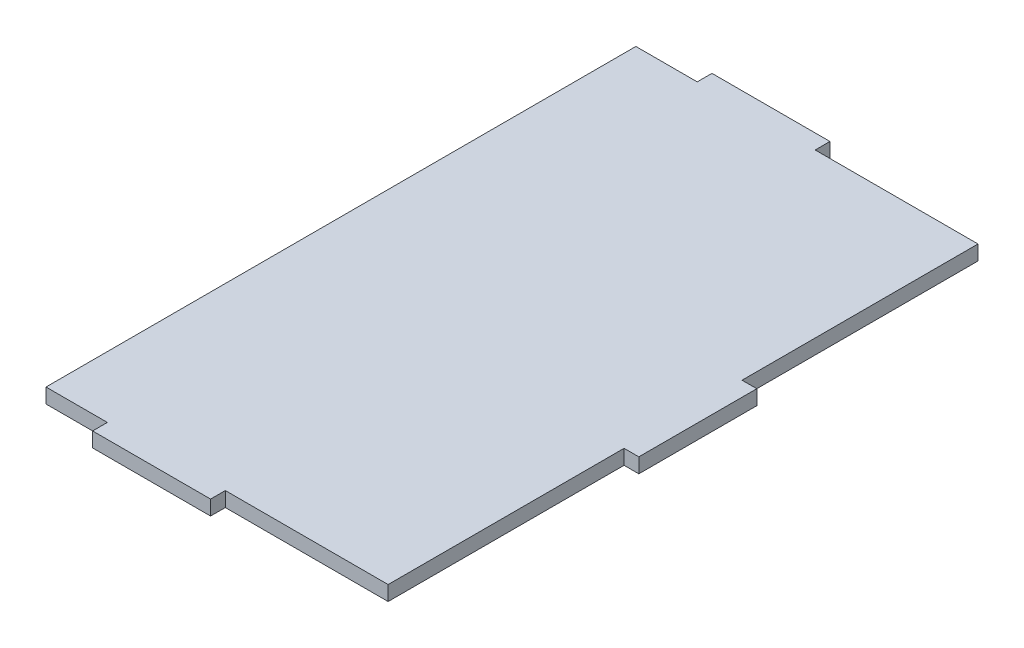
ISO-10303-21;
HEADER;
FILE_DESCRIPTION(('STEP AP214'),'2;1');
FILE_NAME('part.step','',(''),(''),'','','');
FILE_SCHEMA(('AUTOMOTIVE_DESIGN { 1 0 10303 214 1 1 1 1 }'));
ENDSEC;
DATA;
#1=APPLICATION_CONTEXT('core data for automotive mechanical design processes');
#2=APPLICATION_PROTOCOL_DEFINITION('international standard','automotive_design',2000,#1);
#3=PRODUCT_CONTEXT('',#1,'mechanical');
#4=PRODUCT('Part','Part','',(#3));
#5=PRODUCT_RELATED_PRODUCT_CATEGORY('part','',(#4));
#6=PRODUCT_DEFINITION_FORMATION('','',#4);
#7=PRODUCT_DEFINITION_CONTEXT('part definition',#1,'design');
#8=PRODUCT_DEFINITION('design','',#6,#7);
#9=PRODUCT_DEFINITION_SHAPE('','',#8);
#10=(LENGTH_UNIT() NAMED_UNIT(*) SI_UNIT(.MILLI.,.METRE.));
#11=(NAMED_UNIT(*) PLANE_ANGLE_UNIT() SI_UNIT($,.RADIAN.));
#12=(NAMED_UNIT(*) SI_UNIT($,.STERADIAN.) SOLID_ANGLE_UNIT());
#13=UNCERTAINTY_MEASURE_WITH_UNIT(LENGTH_MEASURE(1.E-05),#10,'distance_accuracy_value','');
#14=(GEOMETRIC_REPRESENTATION_CONTEXT(3) GLOBAL_UNCERTAINTY_ASSIGNED_CONTEXT((#13)) GLOBAL_UNIT_ASSIGNED_CONTEXT((#10,
#11,#12)) REPRESENTATION_CONTEXT('',''));
#15=CARTESIAN_POINT('',(0.,0.,0.));
#16=DIRECTION('',(0.,0.,1.));
#17=DIRECTION('',(1.,0.,0.));
#18=AXIS2_PLACEMENT_3D('',#15,#16,#17);
#19=CARTESIAN_POINT('',(1.48166666666671,3.175,-68.2625));
#20=DIRECTION('',(0.,0.,1.));
#21=DIRECTION('',(1.,0.,0.));
#22=AXIS2_PLACEMENT_3D('',#19,#20,#21);
#23=PLANE('',#22);
#24=DIRECTION('',(0.,-1.,0.));
#25=VECTOR('',#24,1.);
#26=CARTESIAN_POINT('',(40.0896666666667,3.175,-68.2625));
#27=LINE('',#26,#25);
#28=CARTESIAN_POINT('',(40.0896666666667,3.175,-68.2625));
#29=VERTEX_POINT('',#28);
#30=CARTESIAN_POINT('',(40.0896666666667,0.,-68.2625));
#31=VERTEX_POINT('',#30);
#32=EDGE_CURVE('E48',#29,#31,#27,.T.);
#33=ORIENTED_EDGE('',*,*,#32,.F.);
#34=DIRECTION('',(-1.,0.,0.));
#35=VECTOR('',#34,1.);
#36=CARTESIAN_POINT('',(1.48166666666671,3.175,-68.2625));
#37=LINE('',#36,#35);
#38=CARTESIAN_POINT('',(75.1416666666667,3.175,-68.2625));
#39=VERTEX_POINT('',#38);
#40=EDGE_CURVE('E243',#39,#29,#37,.T.);
#41=ORIENTED_EDGE('',*,*,#40,.F.);
#42=DIRECTION('',(0.,-1.,0.));
#43=VECTOR('',#42,1.);
#44=CARTESIAN_POINT('',(75.1416666666667,3.175,-68.2625));
#45=LINE('',#44,#43);
#46=CARTESIAN_POINT('',(75.1416666666667,0.,-68.2625));
#47=VERTEX_POINT('',#46);
#48=EDGE_CURVE('E258',#39,#47,#45,.T.);
#49=ORIENTED_EDGE('',*,*,#48,.T.);
#50=DIRECTION('',(-1.,0.,0.));
#51=VECTOR('',#50,1.);
#52=CARTESIAN_POINT('',(1.48166666666671,0.,-68.2625));
#53=LINE('',#52,#51);
#54=EDGE_CURVE('E234',#47,#31,#53,.T.);
#55=ORIENTED_EDGE('',*,*,#54,.T.);
#56=EDGE_LOOP('',(#33,#41,#49,#55));
#57=FACE_BOUND('',#56,.T.);
#58=ADVANCED_FACE('F33',(#57),#23,.F.);
#59=DIRECTION('',(0.,1.,0.));
#60=VECTOR('',#59,1.);
#61=CARTESIAN_POINT('',(14.6896666666667,3.175,-68.2625));
#62=LINE('',#61,#60);
#63=CARTESIAN_POINT('',(14.6896666666667,0.,-68.2625));
#64=VERTEX_POINT('',#63);
#65=CARTESIAN_POINT('',(14.6896666666667,3.175,-68.2625));
#66=VERTEX_POINT('',#65);
#67=EDGE_CURVE('E56',#64,#66,#62,.T.);
#68=ORIENTED_EDGE('',*,*,#67,.F.);
#69=CARTESIAN_POINT('',(1.48166666666671,0.,-68.2625));
#70=VERTEX_POINT('',#69);
#71=EDGE_CURVE('E254',#64,#70,#53,.T.);
#72=ORIENTED_EDGE('',*,*,#71,.T.);
#73=DIRECTION('',(0.,-1.,0.));
#74=VECTOR('',#73,1.);
#75=CARTESIAN_POINT('',(1.48166666666671,3.175,-68.2625));
#76=LINE('',#75,#74);
#77=CARTESIAN_POINT('',(1.48166666666671,3.175,-68.2625));
#78=VERTEX_POINT('',#77);
#79=EDGE_CURVE('E245',#78,#70,#76,.T.);
#80=ORIENTED_EDGE('',*,*,#79,.F.);
#81=EDGE_CURVE('E242',#66,#78,#37,.T.);
#82=ORIENTED_EDGE('',*,*,#81,.F.);
#83=EDGE_LOOP('',(#68,#72,#80,#82));
#84=FACE_BOUND('',#83,.T.);
#85=ADVANCED_FACE('F326',(#84),#23,.F.);
#86=CARTESIAN_POINT('',(1.48166666666673,3.175,58.7375));
#87=DIRECTION('',(0.,0.,-1.));
#88=DIRECTION('',(-1.,0.,0.));
#89=AXIS2_PLACEMENT_3D('',#86,#87,#88);
#90=PLANE('',#89);
#91=DIRECTION('',(0.,-1.,0.));
#92=VECTOR('',#91,1.);
#93=CARTESIAN_POINT('',(14.6896666666667,3.175,58.7375));
#94=LINE('',#93,#92);
#95=CARTESIAN_POINT('',(14.6896666666667,3.175,58.7375));
#96=VERTEX_POINT('',#95);
#97=CARTESIAN_POINT('',(14.6896666666667,0.,58.7375));
#98=VERTEX_POINT('',#97);
#99=EDGE_CURVE('E172',#96,#98,#94,.T.);
#100=ORIENTED_EDGE('',*,*,#99,.F.);
#101=DIRECTION('',(1.,0.,0.));
#102=VECTOR('',#101,1.);
#103=CARTESIAN_POINT('',(1.48166666666673,3.175,58.7375));
#104=LINE('',#103,#102);
#105=CARTESIAN_POINT('',(1.48166666666673,3.175,58.7375));
#106=VERTEX_POINT('',#105);
#107=EDGE_CURVE('E235',#106,#96,#104,.T.);
#108=ORIENTED_EDGE('',*,*,#107,.F.);
#109=DIRECTION('',(0.,-1.,0.));
#110=VECTOR('',#109,1.);
#111=CARTESIAN_POINT('',(1.48166666666673,3.175,58.7375));
#112=LINE('',#111,#110);
#113=CARTESIAN_POINT('',(1.48166666666673,0.,58.7375));
#114=VERTEX_POINT('',#113);
#115=EDGE_CURVE('E11',#106,#114,#112,.T.);
#116=ORIENTED_EDGE('',*,*,#115,.T.);
#117=DIRECTION('',(1.,0.,0.));
#118=VECTOR('',#117,1.);
#119=CARTESIAN_POINT('',(1.48166666666673,0.,58.7375));
#120=LINE('',#119,#118);
#121=EDGE_CURVE('E249',#114,#98,#120,.T.);
#122=ORIENTED_EDGE('',*,*,#121,.T.);
#123=EDGE_LOOP('',(#100,#108,#116,#122));
#124=FACE_BOUND('',#123,.T.);
#125=ADVANCED_FACE('F292',(#124),#90,.F.);
#126=CARTESIAN_POINT('',(75.1416666666667,3.175,-68.2625));
#127=DIRECTION('',(-1.,0.,0.));
#128=DIRECTION('',(0.,0.,1.));
#129=AXIS2_PLACEMENT_3D('',#126,#127,#128);
#130=PLANE('',#129);
#131=DIRECTION('',(0.,-1.,0.));
#132=VECTOR('',#131,1.);
#133=CARTESIAN_POINT('',(75.1416666666667,3.175,7.9375));
#134=LINE('',#133,#132);
#135=CARTESIAN_POINT('',(75.1416666666667,3.175,7.9375));
#136=VERTEX_POINT('',#135);
#137=CARTESIAN_POINT('',(75.1416666666667,0.,7.9375));
#138=VERTEX_POINT('',#137);
#139=EDGE_CURVE('E194',#136,#138,#134,.T.);
#140=ORIENTED_EDGE('',*,*,#139,.F.);
#141=DIRECTION('',(0.,0.,-1.));
#142=VECTOR('',#141,1.);
#143=CARTESIAN_POINT('',(75.1416666666667,3.175,-68.2625));
#144=LINE('',#143,#142);
#145=CARTESIAN_POINT('',(75.1416666666667,3.175,58.7375));
#146=VERTEX_POINT('',#145);
#147=EDGE_CURVE('E239',#146,#136,#144,.T.);
#148=ORIENTED_EDGE('',*,*,#147,.F.);
#149=DIRECTION('',(0.,-1.,0.));
#150=VECTOR('',#149,1.);
#151=CARTESIAN_POINT('',(75.1416666666667,3.175,58.7375));
#152=LINE('',#151,#150);
#153=CARTESIAN_POINT('',(75.1416666666667,0.,58.7375));
#154=VERTEX_POINT('',#153);
#155=EDGE_CURVE('E41',#146,#154,#152,.T.);
#156=ORIENTED_EDGE('',*,*,#155,.T.);
#157=DIRECTION('',(0.,0.,-1.));
#158=VECTOR('',#157,1.);
#159=CARTESIAN_POINT('',(75.1416666666667,0.,-68.2625));
#160=LINE('',#159,#158);
#161=EDGE_CURVE('E252',#154,#138,#160,.T.);
#162=ORIENTED_EDGE('',*,*,#161,.T.);
#163=EDGE_LOOP('',(#140,#148,#156,#162));
#164=FACE_BOUND('',#163,.T.);
#165=ADVANCED_FACE('F265',(#164),#130,.F.);
#166=DIRECTION('',(0.,1.,0.));
#167=VECTOR('',#166,1.);
#168=CARTESIAN_POINT('',(75.1416666666667,3.175,-17.4625));
#169=LINE('',#168,#167);
#170=CARTESIAN_POINT('',(75.1416666666667,0.,-17.4625));
#171=VERTEX_POINT('',#170);
#172=CARTESIAN_POINT('',(75.1416666666667,3.175,-17.4625));
#173=VERTEX_POINT('',#172);
#174=EDGE_CURVE('E207',#171,#173,#169,.T.);
#175=ORIENTED_EDGE('',*,*,#174,.F.);
#176=EDGE_CURVE('E251',#171,#47,#160,.T.);
#177=ORIENTED_EDGE('',*,*,#176,.T.);
#178=ORIENTED_EDGE('',*,*,#48,.F.);
#179=EDGE_CURVE('E238',#173,#39,#144,.T.);
#180=ORIENTED_EDGE('',*,*,#179,.F.);
#181=EDGE_LOOP('',(#175,#177,#178,#180));
#182=FACE_BOUND('',#181,.T.);
#183=ADVANCED_FACE('F335',(#182),#130,.F.);
#184=CARTESIAN_POINT('',(1.48166666666671,3.175,-68.2625));
#185=DIRECTION('',(1.,0.,0.));
#186=DIRECTION('',(0.,0.,-1.));
#187=AXIS2_PLACEMENT_3D('',#184,#185,#186);
#188=PLANE('',#187);
#189=DIRECTION('',(0.,0.,1.));
#190=VECTOR('',#189,1.);
#191=CARTESIAN_POINT('',(1.48166666666671,0.,-68.2625));
#192=LINE('',#191,#190);
#193=EDGE_CURVE('E229',#70,#114,#192,.T.);
#194=ORIENTED_EDGE('',*,*,#193,.T.);
#195=ORIENTED_EDGE('',*,*,#115,.F.);
#196=DIRECTION('',(0.,0.,1.));
#197=VECTOR('',#196,1.);
#198=CARTESIAN_POINT('',(1.48166666666671,3.175,-68.2625));
#199=LINE('',#198,#197);
#200=EDGE_CURVE('E230',#78,#106,#199,.T.);
#201=ORIENTED_EDGE('',*,*,#200,.F.);
#202=ORIENTED_EDGE('',*,*,#79,.T.);
#203=EDGE_LOOP('',(#194,#195,#201,#202));
#204=FACE_BOUND('',#203,.T.);
#205=ADVANCED_FACE('F35',(#204),#188,.F.);
#206=CARTESIAN_POINT('',(40.0896666666667,3.175,58.7375));
#207=VERTEX_POINT('',#206);
#208=EDGE_CURVE('E233',#207,#146,#104,.T.);
#209=ORIENTED_EDGE('',*,*,#208,.F.);
#210=DIRECTION('',(0.,-1.,0.));
#211=VECTOR('',#210,1.);
#212=CARTESIAN_POINT('',(40.0896666666667,3.175,58.7375));
#213=LINE('',#212,#211);
#214=CARTESIAN_POINT('',(40.0896666666667,0.,58.7375));
#215=VERTEX_POINT('',#214);
#216=EDGE_CURVE('E170',#207,#215,#213,.T.);
#217=ORIENTED_EDGE('',*,*,#216,.T.);
#218=EDGE_CURVE('E248',#215,#154,#120,.T.);
#219=ORIENTED_EDGE('',*,*,#218,.T.);
#220=ORIENTED_EDGE('',*,*,#155,.F.);
#221=EDGE_LOOP('',(#209,#217,#219,#220));
#222=FACE_BOUND('',#221,.T.);
#223=ADVANCED_FACE('F279',(#222),#90,.F.);
#224=CARTESIAN_POINT('',(0.,3.175,0.));
#225=DIRECTION('',(0.,1.,0.));
#226=DIRECTION('',(0.,0.,1.));
#227=AXIS2_PLACEMENT_3D('',#224,#225,#226);
#228=PLANE('',#227);
#229=ORIENTED_EDGE('',*,*,#200,.T.);
#230=ORIENTED_EDGE('',*,*,#107,.T.);
#231=DIRECTION('',(0.,0.,-1.));
#232=VECTOR('',#231,1.);
#233=CARTESIAN_POINT('',(14.6896666666667,3.175,61.9125));
#234=LINE('',#233,#232);
#235=CARTESIAN_POINT('',(14.6896666666667,3.175,61.9125));
#236=VERTEX_POINT('',#235);
#237=EDGE_CURVE('E191',#236,#96,#234,.T.);
#238=ORIENTED_EDGE('',*,*,#237,.F.);
#239=DIRECTION('',(1.,0.,0.));
#240=VECTOR('',#239,1.);
#241=CARTESIAN_POINT('',(14.6896666666667,3.175,61.9125));
#242=LINE('',#241,#240);
#243=CARTESIAN_POINT('',(40.0896666666667,3.175,61.9125));
#244=VERTEX_POINT('',#243);
#245=EDGE_CURVE('E178',#236,#244,#242,.T.);
#246=ORIENTED_EDGE('',*,*,#245,.T.);
#247=DIRECTION('',(0.,0.,-1.));
#248=VECTOR('',#247,1.);
#249=CARTESIAN_POINT('',(40.0896666666667,3.175,61.9125));
#250=LINE('',#249,#248);
#251=EDGE_CURVE('E187',#244,#207,#250,.T.);
#252=ORIENTED_EDGE('',*,*,#251,.T.);
#253=ORIENTED_EDGE('',*,*,#208,.T.);
#254=ORIENTED_EDGE('',*,*,#147,.T.);
#255=DIRECTION('',(-1.,0.,0.));
#256=VECTOR('',#255,1.);
#257=CARTESIAN_POINT('',(78.3166666666667,3.175,7.9375));
#258=LINE('',#257,#256);
#259=CARTESIAN_POINT('',(78.3166666666667,3.175,7.9375));
#260=VERTEX_POINT('',#259);
#261=EDGE_CURVE('E213',#260,#136,#258,.T.);
#262=ORIENTED_EDGE('',*,*,#261,.F.);
#263=DIRECTION('',(0.,0.,1.));
#264=VECTOR('',#263,1.);
#265=CARTESIAN_POINT('',(78.3166666666667,3.175,7.9375));
#266=LINE('',#265,#264);
#267=CARTESIAN_POINT('',(78.3166666666667,3.175,-17.4625));
#268=VERTEX_POINT('',#267);
#269=EDGE_CURVE('E211',#268,#260,#266,.T.);
#270=ORIENTED_EDGE('',*,*,#269,.F.);
#271=DIRECTION('',(-1.,0.,0.));
#272=VECTOR('',#271,1.);
#273=CARTESIAN_POINT('',(78.3166666666667,3.175,-17.4625));
#274=LINE('',#273,#272);
#275=EDGE_CURVE('E220',#268,#173,#274,.T.);
#276=ORIENTED_EDGE('',*,*,#275,.T.);
#277=ORIENTED_EDGE('',*,*,#179,.T.);
#278=ORIENTED_EDGE('',*,*,#40,.T.);
#279=DIRECTION('',(0.,0.,1.));
#280=VECTOR('',#279,1.);
#281=CARTESIAN_POINT('',(40.0896666666667,3.175,-71.4375));
#282=LINE('',#281,#280);
#283=CARTESIAN_POINT('',(40.0896666666667,3.175,-71.4375));
#284=VERTEX_POINT('',#283);
#285=EDGE_CURVE('E302',#284,#29,#282,.T.);
#286=ORIENTED_EDGE('',*,*,#285,.F.);
#287=DIRECTION('',(1.,0.,0.));
#288=VECTOR('',#287,1.);
#289=CARTESIAN_POINT('',(40.0896666666667,3.175,-71.4375));
#290=LINE('',#289,#288);
#291=CARTESIAN_POINT('',(14.6896666666667,3.175,-71.4375));
#292=VERTEX_POINT('',#291);
#293=EDGE_CURVE('E164',#292,#284,#290,.T.);
#294=ORIENTED_EDGE('',*,*,#293,.F.);
#295=DIRECTION('',(0.,0.,1.));
#296=VECTOR('',#295,1.);
#297=CARTESIAN_POINT('',(14.6896666666667,3.175,-71.4375));
#298=LINE('',#297,#296);
#299=EDGE_CURVE('E174',#292,#66,#298,.T.);
#300=ORIENTED_EDGE('',*,*,#299,.T.);
#301=ORIENTED_EDGE('',*,*,#81,.T.);
#302=EDGE_LOOP('',(#229,#230,#238,#246,#252,#253,#254,#262,#270,#276,#277,#278,#286,#294,#300,#301));
#303=FACE_BOUND('',#302,.T.);
#304=ADVANCED_FACE('F276',(#303),#228,.T.);
#305=CARTESIAN_POINT('',(0.,0.,0.));
#306=DIRECTION('',(0.,1.,0.));
#307=DIRECTION('',(0.,0.,1.));
#308=AXIS2_PLACEMENT_3D('',#305,#306,#307);
#309=PLANE('',#308);
#310=ORIENTED_EDGE('',*,*,#193,.F.);
#311=ORIENTED_EDGE('',*,*,#71,.F.);
#312=DIRECTION('',(0.,0.,1.));
#313=VECTOR('',#312,1.);
#314=CARTESIAN_POINT('',(14.6896666666667,0.,-71.4375));
#315=LINE('',#314,#313);
#316=CARTESIAN_POINT('',(14.6896666666667,0.,-71.4375));
#317=VERTEX_POINT('',#316);
#318=EDGE_CURVE('E155',#317,#64,#315,.T.);
#319=ORIENTED_EDGE('',*,*,#318,.F.);
#320=DIRECTION('',(-1.,0.,0.));
#321=VECTOR('',#320,1.);
#322=CARTESIAN_POINT('',(40.0896666666667,0.,-71.4375));
#323=LINE('',#322,#321);
#324=CARTESIAN_POINT('',(40.0896666666667,0.,-71.4375));
#325=VERTEX_POINT('',#324);
#326=EDGE_CURVE('E147',#325,#317,#323,.T.);
#327=ORIENTED_EDGE('',*,*,#326,.F.);
#328=DIRECTION('',(0.,0.,1.));
#329=VECTOR('',#328,1.);
#330=CARTESIAN_POINT('',(40.0896666666667,0.,-71.4375));
#331=LINE('',#330,#329);
#332=EDGE_CURVE('E153',#325,#31,#331,.T.);
#333=ORIENTED_EDGE('',*,*,#332,.T.);
#334=ORIENTED_EDGE('',*,*,#54,.F.);
#335=ORIENTED_EDGE('',*,*,#176,.F.);
#336=DIRECTION('',(-1.,0.,0.));
#337=VECTOR('',#336,1.);
#338=CARTESIAN_POINT('',(78.3166666666667,0.,-17.4625));
#339=LINE('',#338,#337);
#340=CARTESIAN_POINT('',(78.3166666666667,0.,-17.4625));
#341=VERTEX_POINT('',#340);
#342=EDGE_CURVE('E223',#341,#171,#339,.T.);
#343=ORIENTED_EDGE('',*,*,#342,.F.);
#344=DIRECTION('',(0.,0.,-1.));
#345=VECTOR('',#344,1.);
#346=CARTESIAN_POINT('',(78.3166666666667,0.,7.9375));
#347=LINE('',#346,#345);
#348=CARTESIAN_POINT('',(78.3166666666667,0.,7.9375));
#349=VERTEX_POINT('',#348);
#350=EDGE_CURVE('E206',#349,#341,#347,.T.);
#351=ORIENTED_EDGE('',*,*,#350,.F.);
#352=DIRECTION('',(-1.,0.,0.));
#353=VECTOR('',#352,1.);
#354=CARTESIAN_POINT('',(78.3166666666667,0.,7.9375));
#355=LINE('',#354,#353);
#356=EDGE_CURVE('E226',#349,#138,#355,.T.);
#357=ORIENTED_EDGE('',*,*,#356,.T.);
#358=ORIENTED_EDGE('',*,*,#161,.F.);
#359=ORIENTED_EDGE('',*,*,#218,.F.);
#360=DIRECTION('',(0.,0.,-1.));
#361=VECTOR('',#360,1.);
#362=CARTESIAN_POINT('',(40.0896666666667,0.,61.9125));
#363=LINE('',#362,#361);
#364=CARTESIAN_POINT('',(40.0896666666667,0.,61.9125));
#365=VERTEX_POINT('',#364);
#366=EDGE_CURVE('E198',#365,#215,#363,.T.);
#367=ORIENTED_EDGE('',*,*,#366,.F.);
#368=DIRECTION('',(1.,0.,0.));
#369=VECTOR('',#368,1.);
#370=CARTESIAN_POINT('',(14.6896666666667,0.,61.9125));
#371=LINE('',#370,#369);
#372=CARTESIAN_POINT('',(14.6896666666667,0.,61.9125));
#373=VERTEX_POINT('',#372);
#374=EDGE_CURVE('E184',#373,#365,#371,.T.);
#375=ORIENTED_EDGE('',*,*,#374,.F.);
#376=DIRECTION('',(0.,0.,-1.));
#377=VECTOR('',#376,1.);
#378=CARTESIAN_POINT('',(14.6896666666667,0.,61.9125));
#379=LINE('',#378,#377);
#380=EDGE_CURVE('E195',#373,#98,#379,.T.);
#381=ORIENTED_EDGE('',*,*,#380,.T.);
#382=ORIENTED_EDGE('',*,*,#121,.F.);
#383=EDGE_LOOP('',(#310,#311,#319,#327,#333,#334,#335,#343,#351,#357,#358,#359,#367,#375,#381,#382));
#384=FACE_BOUND('',#383,.T.);
#385=ADVANCED_FACE('F150',(#384),#309,.F.);
#386=CARTESIAN_POINT('',(78.3166666666667,3.175,7.9375));
#387=DIRECTION('',(0.,0.,-1.));
#388=DIRECTION('',(-1.,0.,0.));
#389=AXIS2_PLACEMENT_3D('',#386,#387,#388);
#390=PLANE('',#389);
#391=ORIENTED_EDGE('',*,*,#139,.T.);
#392=ORIENTED_EDGE('',*,*,#356,.F.);
#393=DIRECTION('',(0.,-1.,0.));
#394=VECTOR('',#393,1.);
#395=CARTESIAN_POINT('',(78.3166666666667,3.175,7.9375));
#396=LINE('',#395,#394);
#397=EDGE_CURVE('E203',#260,#349,#396,.T.);
#398=ORIENTED_EDGE('',*,*,#397,.F.);
#399=ORIENTED_EDGE('',*,*,#261,.T.);
#400=EDGE_LOOP('',(#391,#392,#398,#399));
#401=FACE_BOUND('',#400,.T.);
#402=ADVANCED_FACE('F273',(#401),#390,.F.);
#403=CARTESIAN_POINT('',(78.3166666666667,3.175,-17.4625));
#404=DIRECTION('',(0.,0.,1.));
#405=DIRECTION('',(0.,-1.,0.));
#406=AXIS2_PLACEMENT_3D('',#403,#404,#405);
#407=PLANE('',#406);
#408=ORIENTED_EDGE('',*,*,#174,.T.);
#409=ORIENTED_EDGE('',*,*,#275,.F.);
#410=DIRECTION('',(0.,1.,0.));
#411=VECTOR('',#410,1.);
#412=CARTESIAN_POINT('',(78.3166666666667,3.175,-17.4625));
#413=LINE('',#412,#411);
#414=EDGE_CURVE('E209',#341,#268,#413,.T.);
#415=ORIENTED_EDGE('',*,*,#414,.F.);
#416=ORIENTED_EDGE('',*,*,#342,.T.);
#417=EDGE_LOOP('',(#408,#409,#415,#416));
#418=FACE_BOUND('',#417,.T.);
#419=ADVANCED_FACE('F312',(#418),#407,.F.);
#420=CARTESIAN_POINT('',(78.3166666666667,0.,0.));
#421=DIRECTION('',(1.,0.,0.));
#422=DIRECTION('',(0.,0.,-1.));
#423=AXIS2_PLACEMENT_3D('',#420,#421,#422);
#424=PLANE('',#423);
#425=ORIENTED_EDGE('',*,*,#397,.T.);
#426=ORIENTED_EDGE('',*,*,#350,.T.);
#427=ORIENTED_EDGE('',*,*,#414,.T.);
#428=ORIENTED_EDGE('',*,*,#269,.T.);
#429=EDGE_LOOP('',(#425,#426,#427,#428));
#430=FACE_BOUND('',#429,.T.);
#431=ADVANCED_FACE('F315',(#430),#424,.T.);
#432=CARTESIAN_POINT('',(14.6896666666667,3.175,61.9125));
#433=DIRECTION('',(1.,0.,0.));
#434=DIRECTION('',(0.,0.,-1.));
#435=AXIS2_PLACEMENT_3D('',#432,#433,#434);
#436=PLANE('',#435);
#437=ORIENTED_EDGE('',*,*,#99,.T.);
#438=ORIENTED_EDGE('',*,*,#380,.F.);
#439=DIRECTION('',(0.,-1.,0.));
#440=VECTOR('',#439,1.);
#441=CARTESIAN_POINT('',(14.6896666666667,3.175,61.9125));
#442=LINE('',#441,#440);
#443=EDGE_CURVE('E186',#236,#373,#442,.T.);
#444=ORIENTED_EDGE('',*,*,#443,.F.);
#445=ORIENTED_EDGE('',*,*,#237,.T.);
#446=EDGE_LOOP('',(#437,#438,#444,#445));
#447=FACE_BOUND('',#446,.T.);
#448=ADVANCED_FACE('F290',(#447),#436,.F.);
#449=CARTESIAN_POINT('',(40.0896666666667,3.175,61.9125));
#450=DIRECTION('',(1.,0.,0.));
#451=DIRECTION('',(0.,0.,-1.));
#452=AXIS2_PLACEMENT_3D('',#449,#450,#451);
#453=PLANE('',#452);
#454=ORIENTED_EDGE('',*,*,#216,.F.);
#455=ORIENTED_EDGE('',*,*,#251,.F.);
#456=DIRECTION('',(0.,-1.,0.));
#457=VECTOR('',#456,1.);
#458=CARTESIAN_POINT('',(40.0896666666667,3.175,61.9125));
#459=LINE('',#458,#457);
#460=EDGE_CURVE('E181',#244,#365,#459,.T.);
#461=ORIENTED_EDGE('',*,*,#460,.T.);
#462=ORIENTED_EDGE('',*,*,#366,.T.);
#463=EDGE_LOOP('',(#454,#455,#461,#462));
#464=FACE_BOUND('',#463,.T.);
#465=ADVANCED_FACE('F281',(#464),#453,.T.);
#466=CARTESIAN_POINT('',(0.,0.,61.9125));
#467=DIRECTION('',(0.,0.,-1.));
#468=DIRECTION('',(-1.,0.,0.));
#469=AXIS2_PLACEMENT_3D('',#466,#467,#468);
#470=PLANE('',#469);
#471=ORIENTED_EDGE('',*,*,#245,.F.);
#472=ORIENTED_EDGE('',*,*,#443,.T.);
#473=ORIENTED_EDGE('',*,*,#374,.T.);
#474=ORIENTED_EDGE('',*,*,#460,.F.);
#475=EDGE_LOOP('',(#471,#472,#473,#474));
#476=FACE_BOUND('',#475,.T.);
#477=ADVANCED_FACE('F287',(#476),#470,.F.);
#478=CARTESIAN_POINT('',(40.0896666666667,3.175,-71.4375));
#479=DIRECTION('',(-1.,0.,0.));
#480=DIRECTION('',(0.,0.,1.));
#481=AXIS2_PLACEMENT_3D('',#478,#479,#480);
#482=PLANE('',#481);
#483=ORIENTED_EDGE('',*,*,#32,.T.);
#484=ORIENTED_EDGE('',*,*,#332,.F.);
#485=DIRECTION('',(0.,-1.,0.));
#486=VECTOR('',#485,1.);
#487=CARTESIAN_POINT('',(40.0896666666667,3.175,-71.4375));
#488=LINE('',#487,#486);
#489=EDGE_CURVE('E159',#284,#325,#488,.T.);
#490=ORIENTED_EDGE('',*,*,#489,.F.);
#491=ORIENTED_EDGE('',*,*,#285,.T.);
#492=EDGE_LOOP('',(#483,#484,#490,#491));
#493=FACE_BOUND('',#492,.T.);
#494=ADVANCED_FACE('F169',(#493),#482,.F.);
#495=CARTESIAN_POINT('',(14.6896666666667,3.175,-71.4375));
#496=DIRECTION('',(1.,0.,0.));
#497=DIRECTION('',(0.,0.,-1.));
#498=AXIS2_PLACEMENT_3D('',#495,#496,#497);
#499=PLANE('',#498);
#500=ORIENTED_EDGE('',*,*,#67,.T.);
#501=ORIENTED_EDGE('',*,*,#299,.F.);
#502=DIRECTION('',(0.,1.,0.));
#503=VECTOR('',#502,1.);
#504=CARTESIAN_POINT('',(14.6896666666667,3.175,-71.4375));
#505=LINE('',#504,#503);
#506=EDGE_CURVE('E158',#317,#292,#505,.T.);
#507=ORIENTED_EDGE('',*,*,#506,.F.);
#508=ORIENTED_EDGE('',*,*,#318,.T.);
#509=EDGE_LOOP('',(#500,#501,#507,#508));
#510=FACE_BOUND('',#509,.T.);
#511=ADVANCED_FACE('F299',(#510),#499,.F.);
#512=CARTESIAN_POINT('',(0.,0.,-71.4375));
#513=DIRECTION('',(0.,0.,-1.));
#514=DIRECTION('',(-1.,0.,0.));
#515=AXIS2_PLACEMENT_3D('',#512,#513,#514);
#516=PLANE('',#515);
#517=ORIENTED_EDGE('',*,*,#489,.T.);
#518=ORIENTED_EDGE('',*,*,#326,.T.);
#519=ORIENTED_EDGE('',*,*,#506,.T.);
#520=ORIENTED_EDGE('',*,*,#293,.T.);
#521=EDGE_LOOP('',(#517,#518,#519,#520));
#522=FACE_BOUND('',#521,.T.);
#523=ADVANCED_FACE('F162',(#522),#516,.T.);
#524=CLOSED_SHELL('',(#58,#85,#125,#165,#183,#205,#223,#304,#385,#402,#419,#431,#448,#465,#477,
#494,#511,#523));
#525=MANIFOLD_SOLID_BREP('B2',#524);
#526=ADVANCED_BREP_SHAPE_REPRESENTATION('',(#18,#525),#14);
#527=SHAPE_DEFINITION_REPRESENTATION(#9,#526);
ENDSEC;
END-ISO-10303-21;
